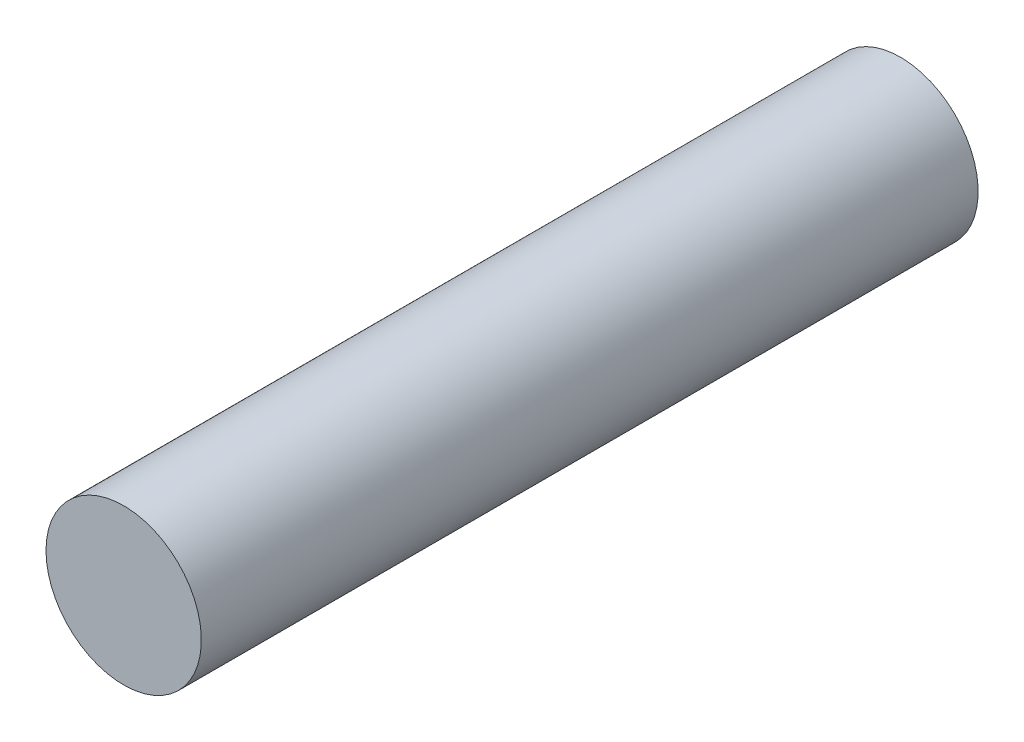
ISO-10303-21;
HEADER;
FILE_DESCRIPTION(('STEP AP214'),'2;1');
FILE_NAME('part.step','',(''),(''),'','','');
FILE_SCHEMA(('AUTOMOTIVE_DESIGN { 1 0 10303 214 1 1 1 1 }'));
ENDSEC;
DATA;
#1=APPLICATION_CONTEXT('core data for automotive mechanical design processes');
#2=APPLICATION_PROTOCOL_DEFINITION('international standard','automotive_design',2000,#1);
#3=PRODUCT_CONTEXT('',#1,'mechanical');
#4=PRODUCT('Part','Part','',(#3));
#5=PRODUCT_RELATED_PRODUCT_CATEGORY('part','',(#4));
#6=PRODUCT_DEFINITION_FORMATION('','',#4);
#7=PRODUCT_DEFINITION_CONTEXT('part definition',#1,'design');
#8=PRODUCT_DEFINITION('design','',#6,#7);
#9=PRODUCT_DEFINITION_SHAPE('','',#8);
#10=(LENGTH_UNIT() NAMED_UNIT(*) SI_UNIT(.MILLI.,.METRE.));
#11=(NAMED_UNIT(*) PLANE_ANGLE_UNIT() SI_UNIT($,.RADIAN.));
#12=(NAMED_UNIT(*) SI_UNIT($,.STERADIAN.) SOLID_ANGLE_UNIT());
#13=UNCERTAINTY_MEASURE_WITH_UNIT(LENGTH_MEASURE(1.E-05),#10,'distance_accuracy_value','');
#14=(GEOMETRIC_REPRESENTATION_CONTEXT(3) GLOBAL_UNCERTAINTY_ASSIGNED_CONTEXT((#13)) GLOBAL_UNIT_ASSIGNED_CONTEXT((#10,
#11,#12)) REPRESENTATION_CONTEXT('',''));
#15=CARTESIAN_POINT('',(0.,0.,0.));
#16=DIRECTION('',(0.,0.,1.));
#17=DIRECTION('',(1.,0.,0.));
#18=AXIS2_PLACEMENT_3D('',#15,#16,#17);
#19=CARTESIAN_POINT('',(0.,0.,-3.));
#20=DIRECTION('',(0.,0.,1.));
#21=DIRECTION('',(1.,0.,0.));
#22=AXIS2_PLACEMENT_3D('',#19,#20,#21);
#23=PLANE('',#22);
#24=CARTESIAN_POINT('',(0.,0.,-3.));
#25=DIRECTION('',(0.,0.,-1.));
#26=DIRECTION('',(-1.,0.,0.));
#27=AXIS2_PLACEMENT_3D('',#24,#25,#26);
#28=CIRCLE('',#27,0.3);
#29=CARTESIAN_POINT('',(-0.3,0.,-3.));
#30=VERTEX_POINT('',#29);
#31=EDGE_CURVE('E17',#30,#30,#28,.F.);
#32=ORIENTED_EDGE('',*,*,#31,.F.);
#33=EDGE_LOOP('',(#32));
#34=FACE_BOUND('',#33,.T.);
#35=ADVANCED_FACE('F14',(#34),#23,.F.);
#36=CARTESIAN_POINT('',(0.,0.,0.));
#37=DIRECTION('',(0.,0.,1.));
#38=DIRECTION('',(1.,0.,0.));
#39=AXIS2_PLACEMENT_3D('',#36,#37,#38);
#40=PLANE('',#39);
#41=CARTESIAN_POINT('',(0.,0.,0.));
#42=DIRECTION('',(0.,0.,-1.));
#43=DIRECTION('',(-1.,0.,0.));
#44=AXIS2_PLACEMENT_3D('',#41,#42,#43);
#45=CIRCLE('',#44,0.3);
#46=CARTESIAN_POINT('',(-0.3,0.,0.));
#47=VERTEX_POINT('',#46);
#48=EDGE_CURVE('E9',#47,#47,#45,.T.);
#49=ORIENTED_EDGE('',*,*,#48,.F.);
#50=EDGE_LOOP('',(#49));
#51=FACE_BOUND('',#50,.T.);
#52=ADVANCED_FACE('F29',(#51),#40,.T.);
#53=CARTESIAN_POINT('',(0.,0.,0.));
#54=DIRECTION('',(0.,0.,-1.));
#55=DIRECTION('',(-1.,0.,0.));
#56=AXIS2_PLACEMENT_3D('',#53,#54,#55);
#57=CYLINDRICAL_SURFACE('',#56,0.3);
#58=ORIENTED_EDGE('',*,*,#48,.T.);
#59=EDGE_LOOP('',(#58));
#60=FACE_BOUND('',#59,.T.);
#61=ORIENTED_EDGE('',*,*,#31,.T.);
#62=EDGE_LOOP('',(#61));
#63=FACE_BOUND('',#62,.T.);
#64=ADVANCED_FACE('F26',(#60,#63),#57,.T.);
#65=CLOSED_SHELL('',(#35,#52,#64));
#66=MANIFOLD_SOLID_BREP('B1',#65);
#67=ADVANCED_BREP_SHAPE_REPRESENTATION('',(#18,#66),#14);
#68=SHAPE_DEFINITION_REPRESENTATION(#9,#67);
ENDSEC;
END-ISO-10303-21;
